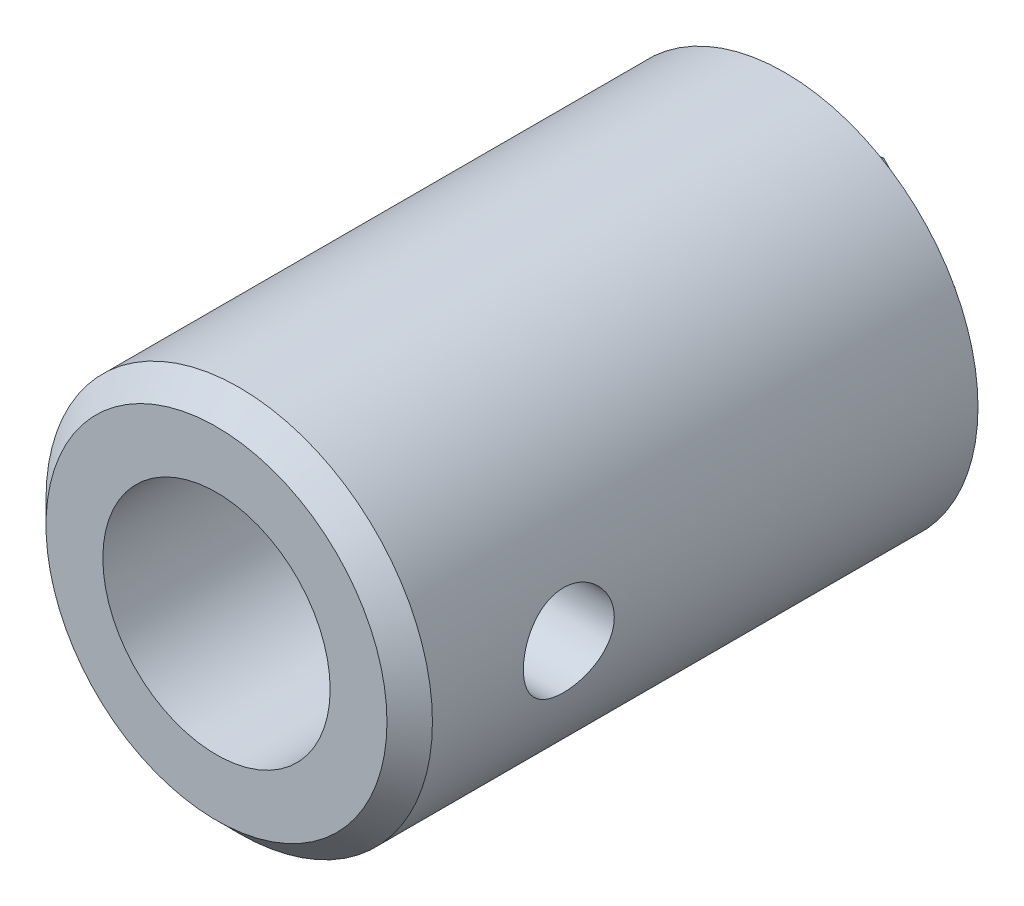
ISO-10303-21;
HEADER;
FILE_DESCRIPTION(('STEP AP214'),'2;1');
FILE_NAME('part.step','',(''),(''),'','','');
FILE_SCHEMA(('AUTOMOTIVE_DESIGN { 1 0 10303 214 1 1 1 1 }'));
ENDSEC;
DATA;
#1=APPLICATION_CONTEXT('core data for automotive mechanical design processes');
#2=APPLICATION_PROTOCOL_DEFINITION('international standard','automotive_design',2000,#1);
#3=PRODUCT_CONTEXT('',#1,'mechanical');
#4=PRODUCT('Part','Part','',(#3));
#5=PRODUCT_RELATED_PRODUCT_CATEGORY('part','',(#4));
#6=PRODUCT_DEFINITION_FORMATION('','',#4);
#7=PRODUCT_DEFINITION_CONTEXT('part definition',#1,'design');
#8=PRODUCT_DEFINITION('design','',#6,#7);
#9=PRODUCT_DEFINITION_SHAPE('','',#8);
#10=(LENGTH_UNIT() NAMED_UNIT(*) SI_UNIT(.MILLI.,.METRE.));
#11=(NAMED_UNIT(*) PLANE_ANGLE_UNIT() SI_UNIT($,.RADIAN.));
#12=(NAMED_UNIT(*) SI_UNIT($,.STERADIAN.) SOLID_ANGLE_UNIT());
#13=UNCERTAINTY_MEASURE_WITH_UNIT(LENGTH_MEASURE(1.E-05),#10,'distance_accuracy_value','');
#14=(GEOMETRIC_REPRESENTATION_CONTEXT(3) GLOBAL_UNCERTAINTY_ASSIGNED_CONTEXT((#13)) GLOBAL_UNIT_ASSIGNED_CONTEXT((#10,
#11,#12)) REPRESENTATION_CONTEXT('',''));
#15=CARTESIAN_POINT('',(0.,0.,0.));
#16=DIRECTION('',(0.,0.,1.));
#17=DIRECTION('',(1.,0.,0.));
#18=AXIS2_PLACEMENT_3D('',#15,#16,#17);
#19=CARTESIAN_POINT('',(0.,0.,0.));
#20=DIRECTION('',(0.,0.,1.));
#21=DIRECTION('',(1.,0.,0.));
#22=AXIS2_PLACEMENT_3D('',#19,#20,#21);
#23=PLANE('',#22);
#24=CARTESIAN_POINT('',(0.,0.,0.));
#25=DIRECTION('',(0.,0.,1.));
#26=DIRECTION('',(1.,0.,0.));
#27=AXIS2_PLACEMENT_3D('',#24,#25,#26);
#28=CIRCLE('',#27,8.5);
#29=CARTESIAN_POINT('',(8.5,0.,0.));
#30=VERTEX_POINT('',#29);
#31=EDGE_CURVE('E126',#30,#30,#28,.T.);
#32=ORIENTED_EDGE('',*,*,#31,.F.);
#33=EDGE_LOOP('',(#32));
#34=FACE_BOUND('',#33,.T.);
#35=DIRECTION('',(0.681876905278028,-0.731466941186312,0.));
#36=VECTOR('',#35,1.);
#37=CARTESIAN_POINT('',(1.35114050547941,4.41675816270103,0.));
#38=LINE('',#37,#36);
#39=CARTESIAN_POINT('',(1.35114050547941,4.41675816270103,0.));
#40=VERTEX_POINT('',#39);
#41=CARTESIAN_POINT('',(4.50059502401108,1.0382570795232,0.));
#42=VERTEX_POINT('',#41);
#43=EDGE_CURVE('E114',#40,#42,#38,.T.);
#44=ORIENTED_EDGE('',*,*,#43,.F.);
#45=DIRECTION('',(0.974407405734858,0.224789251631532,0.));
#46=VECTOR('',#45,1.);
#47=CARTESIAN_POINT('',(-3.14945451853167,3.37850108317783,0.));
#48=LINE('',#47,#46);
#49=CARTESIAN_POINT('',(-3.14945451853167,3.37850108317784,0.));
#50=VERTEX_POINT('',#49);
#51=EDGE_CURVE('E111',#50,#40,#48,.T.);
#52=ORIENTED_EDGE('',*,*,#51,.F.);
#53=DIRECTION('',(0.29253050045683,0.956256192817844,0.));
#54=VECTOR('',#53,1.);
#55=CARTESIAN_POINT('',(-4.50059502401108,-1.0382570795232,0.));
#56=LINE('',#55,#54);
#57=CARTESIAN_POINT('',(-4.50059502401108,-1.0382570795232,0.));
#58=VERTEX_POINT('',#57);
#59=EDGE_CURVE('E241',#58,#50,#56,.T.);
#60=ORIENTED_EDGE('',*,*,#59,.F.);
#61=DIRECTION('',(-0.681876905278028,0.731466941186312,0.));
#62=VECTOR('',#61,1.);
#63=CARTESIAN_POINT('',(-1.35114050547941,-4.41675816270103,0.));
#64=LINE('',#63,#62);
#65=CARTESIAN_POINT('',(-1.35114050547941,-4.41675816270103,0.));
#66=VERTEX_POINT('',#65);
#67=EDGE_CURVE('E238',#66,#58,#64,.T.);
#68=ORIENTED_EDGE('',*,*,#67,.F.);
#69=DIRECTION('',(-0.974407405734858,-0.224789251631532,0.));
#70=VECTOR('',#69,1.);
#71=CARTESIAN_POINT('',(3.14945451853167,-3.37850108317783,0.));
#72=LINE('',#71,#70);
#73=CARTESIAN_POINT('',(3.14945451853167,-3.37850108317783,0.));
#74=VERTEX_POINT('',#73);
#75=EDGE_CURVE('E60',#74,#66,#72,.T.);
#76=ORIENTED_EDGE('',*,*,#75,.F.);
#77=DIRECTION('',(-0.292530500456829,-0.956256192817844,0.));
#78=VECTOR('',#77,1.);
#79=CARTESIAN_POINT('',(4.50059502401108,1.0382570795232,0.));
#80=LINE('',#79,#78);
#81=EDGE_CURVE('E55',#42,#74,#80,.T.);
#82=ORIENTED_EDGE('',*,*,#81,.F.);
#83=EDGE_LOOP('',(#44,#52,#60,#68,#76,#82));
#84=FACE_BOUND('',#83,.T.);
#85=ADVANCED_FACE('F40',(#34,#84),#23,.F.);
#86=CARTESIAN_POINT('',(0.,0.,5.));
#87=DIRECTION('',(0.,0.,1.));
#88=DIRECTION('',(1.,0.,0.));
#89=AXIS2_PLACEMENT_3D('',#86,#87,#88);
#90=PLANE('',#89);
#91=CARTESIAN_POINT('',(0.,0.,5.));
#92=DIRECTION('',(0.,0.,1.));
#93=DIRECTION('',(1.,0.,0.));
#94=AXIS2_PLACEMENT_3D('',#91,#92,#93);
#95=CIRCLE('',#94,5.);
#96=CARTESIAN_POINT('',(5.,0.,5.));
#97=VERTEX_POINT('',#96);
#98=EDGE_CURVE('E129',#97,#97,#95,.F.);
#99=ORIENTED_EDGE('',*,*,#98,.F.);
#100=EDGE_LOOP('',(#99));
#101=FACE_BOUND('',#100,.T.);
#102=CARTESIAN_POINT('',(0.,0.,5.));
#103=DIRECTION('',(0.,0.,1.));
#104=DIRECTION('',(1.,0.,0.));
#105=AXIS2_PLACEMENT_3D('',#102,#103,#104);
#106=CIRCLE('',#105,2.);
#107=CARTESIAN_POINT('',(2.,0.,5.));
#108=VERTEX_POINT('',#107);
#109=EDGE_CURVE('E118',#108,#108,#106,.T.);
#110=ORIENTED_EDGE('',*,*,#109,.F.);
#111=EDGE_LOOP('',(#110));
#112=FACE_BOUND('',#111,.T.);
#113=ADVANCED_FACE('F152',(#101,#112),#90,.T.);
#114=CARTESIAN_POINT('',(0.,0.,5.));
#115=DIRECTION('',(0.,0.,-1.));
#116=DIRECTION('',(-1.,0.,0.));
#117=AXIS2_PLACEMENT_3D('',#114,#115,#116);
#118=CYLINDRICAL_SURFACE('',#117,8.5);
#119=CARTESIAN_POINT('',(8.5,0.,16.));
#120=CARTESIAN_POINT('',(8.49999801750481,0.110707222526124,16.0000034564406));
#121=CARTESIAN_POINT('',(8.49781540060716,0.221454521072923,16.0092230526165));
#122=CARTESIAN_POINT('',(8.48931965269305,0.439788787350876,16.04581087604));
#123=CARTESIAN_POINT('',(8.48300388462288,0.547373691572941,16.0731906901113));
#124=CARTESIAN_POINT('',(8.4669430800191,0.756197517316249,16.1451823953729));
#125=CARTESIAN_POINT('',(8.45720190485864,0.857443433845184,16.1897748886609));
#126=CARTESIAN_POINT('',(8.43533444577621,1.0510155369327,16.29486106804));
#127=CARTESIAN_POINT('',(8.42320814931182,1.14334167658186,16.3553548377503));
#128=CARTESIAN_POINT('',(8.39764327718341,1.31815374652725,16.4917031152311));
#129=CARTESIAN_POINT('',(8.38418634599685,1.40045211681902,16.5677946687571));
#130=CARTESIAN_POINT('',(8.3576023587247,1.55124417062838,16.7326703662886));
#131=CARTESIAN_POINT('',(8.34447533602387,1.61973646193728,16.8214557888058));
#132=CARTESIAN_POINT('',(8.31985447393301,1.74182760532487,17.0106214613995));
#133=CARTESIAN_POINT('',(8.30838404762359,1.79522157802198,17.1111372665124));
#134=CARTESIAN_POINT('',(8.28864082978449,1.88428453492285,17.3200304396746));
#135=CARTESIAN_POINT('',(8.28036759056153,1.91995600096022,17.4284067045193));
#136=CARTESIAN_POINT('',(8.2681433438507,1.97193118009561,17.6478951195353));
#137=CARTESIAN_POINT('',(8.26411772364193,1.98856967737172,17.7589237439898));
#138=CARTESIAN_POINT('',(8.26062082026474,2.00304855484246,17.9822637963029));
#139=CARTESIAN_POINT('',(8.26114888525169,2.00089162553843,18.0945750382607));
#140=CARTESIAN_POINT('',(8.26663238190337,1.97810910167244,18.3147643318213));
#141=CARTESIAN_POINT('',(8.27149336028226,1.95787749619193,18.4226858628878));
#142=CARTESIAN_POINT('',(8.28494503088792,1.90014632726017,18.6335585112896));
#143=CARTESIAN_POINT('',(8.29353596158136,1.86264565973852,18.736509310364));
#144=CARTESIAN_POINT('',(8.31356933146056,1.77109260203966,18.9355993150008));
#145=CARTESIAN_POINT('',(8.32503693669168,1.71689311623115,19.0316682392775));
#146=CARTESIAN_POINT('',(8.34951675356641,1.59358407474821,19.2134911691473));
#147=CARTESIAN_POINT('',(8.36252920661224,1.52447218743741,19.2992435584236));
#148=CARTESIAN_POINT('',(8.38903394638453,1.37123756634556,19.4602622907461));
#149=CARTESIAN_POINT('',(8.40253007115743,1.28678108396336,19.5352107455763));
#150=CARTESIAN_POINT('',(8.42818503228671,1.10634012247957,19.6699368159688));
#151=CARTESIAN_POINT('',(8.4403438364415,1.01035536590296,19.7297140662663));
#152=CARTESIAN_POINT('',(8.46200394642273,0.809160897355915,19.8324988202337));
#153=CARTESIAN_POINT('',(8.47149782003105,0.703926440039183,19.8754595532797));
#154=CARTESIAN_POINT('',(8.48670384958574,0.487457687798598,19.942996137397));
#155=CARTESIAN_POINT('',(8.49241664415731,0.376224409511196,19.9675750932463));
#156=CARTESIAN_POINT('',(8.49932407764157,0.153637663571891,19.9971762025668));
#157=CARTESIAN_POINT('',(8.50061885597204,0.0423448759149325,20.0026318862663));
#158=CARTESIAN_POINT('',(8.49882735084224,-0.179562447634433,19.9950138381952));
#159=CARTESIAN_POINT('',(8.49574141406895,-0.290177036503304,19.9819415727148));
#160=CARTESIAN_POINT('',(8.4855989282765,-0.506115547274072,19.9379972132707));
#161=CARTESIAN_POINT('',(8.47859417913237,-0.611489350752371,19.9073572055214));
#162=CARTESIAN_POINT('',(8.46140046160523,-0.815599145285605,19.8294085651773));
#163=CARTESIAN_POINT('',(8.45121119444604,-0.914334512456049,19.7820983685079));
#164=CARTESIAN_POINT('',(8.42853504656538,-1.10412269234789,19.6712816590721));
#165=CARTESIAN_POINT('',(8.41601380204274,-1.19502614893552,19.6075265491899));
#166=CARTESIAN_POINT('',(8.39012409804059,-1.36499902472579,19.4659521169624));
#167=CARTESIAN_POINT('',(8.37675551017066,-1.44406664441852,19.3881306599449));
#168=CARTESIAN_POINT('',(8.35032432460353,-1.58987521562228,19.2186302340775));
#169=CARTESIAN_POINT('',(8.337274528673,-1.65631382120375,19.1266887849848));
#170=CARTESIAN_POINT('',(8.31328366919846,-1.77281313863698,18.9327014872794));
#171=CARTESIAN_POINT('',(8.30234251141978,-1.82287458245114,18.8306560905191));
#172=CARTESIAN_POINT('',(8.28392155078471,-1.90483844015696,18.6199148677443));
#173=CARTESIAN_POINT('',(8.27642150929975,-1.936847290954,18.5112622974374));
#174=CARTESIAN_POINT('',(8.26570319885666,-1.98209519216249,18.2899179669515));
#175=CARTESIAN_POINT('',(8.26248411864936,-1.99533779883918,18.1772269762176));
#176=CARTESIAN_POINT('',(8.26074892411982,-2.00250786658812,17.9540670323244));
#177=CARTESIAN_POINT('',(8.26211563101112,-1.99691656853304,17.8436141892436));
#178=CARTESIAN_POINT('',(8.26912996315445,-1.96766652984528,17.6252729639171));
#179=CARTESIAN_POINT('',(8.27477752057995,-1.94400807547166,17.5173845410683));
#180=CARTESIAN_POINT('',(8.28965579164934,-1.87954382970523,17.3076894774335));
#181=CARTESIAN_POINT('',(8.29886967522321,-1.83881850605662,17.205856824553));
#182=CARTESIAN_POINT('',(8.31984668167287,-1.74144219098133,17.0104017866367));
#183=CARTESIAN_POINT('',(8.33161011669299,-1.68478924926668,16.9167804088893));
#184=CARTESIAN_POINT('',(8.35670265527952,-1.55561482360098,16.7380569414012));
#185=CARTESIAN_POINT('',(8.37006180674132,-1.4827549558821,16.6532035961677));
#186=CARTESIAN_POINT('',(8.3966506561662,-1.32390732881552,16.4967706459752));
#187=CARTESIAN_POINT('',(8.40988032313166,-1.23791650403864,16.4251941491676));
#188=CARTESIAN_POINT('',(8.43496426083158,-1.05363595816287,16.2962710677008));
#189=CARTESIAN_POINT('',(8.44679396805159,-0.955175905199521,16.2391628549814));
#190=CARTESIAN_POINT('',(8.4674927014593,-0.749789351513639,16.1423991533379));
#191=CARTESIAN_POINT('',(8.47636402617268,-0.642869503952003,16.1027301073287));
#192=CARTESIAN_POINT('',(8.48870155772743,-0.446656582230613,16.0484396269269));
#193=CARTESIAN_POINT('',(8.49291078599891,-0.358363661577137,16.0303117328842));
#194=CARTESIAN_POINT('',(8.49856073191377,-0.180055929660539,16.0060908677956));
#195=CARTESIAN_POINT('',(8.5000016124177,-0.0900412200041043,15.9999971887821));
#196=CARTESIAN_POINT('',(8.5,0.,16.));
#197=B_SPLINE_CURVE_WITH_KNOTS('',3,(#119,#120,#121,#122,#123,#124,#125,#126,#127,#128,#129,
#130,#131,#132,#133,#134,#135,#136,#137,#138,#139,#140,#141,#142,#143,#144,#145,#146,#147,#148,
#149,#150,#151,#152,#153,#154,#155,#156,#157,#158,#159,#160,#161,#162,#163,#164,#165,#166,#167,
#168,#169,#170,#171,#172,#173,#174,#175,#176,#177,#178,#179,#180,#181,#182,#183,#184,#185,#186,
#187,#188,#189,#190,#191,#192,#193,#194,#195,#196),.UNSPECIFIED.,.T.,.F.,(4,2,2,2,2,2,2,2,2,2,2,
2,2,2,2,2,2,2,2,2,2,2,2,2,2,2,2,2,2,2,2,2,2,2,2,2,2,2,4),(0.,0.33179188856896,0.663795675313147,
0.995426396224179,1.32705886109823,1.66416482514813,2.00130476606585,2.34282124715151,
2.68428988928473,3.01965509679603,3.35497229870821,3.68315396602227,4.0113566180301,
4.34253723635987,4.67376967418079,5.0133309031367,5.3529003066598,5.69340753264886,
6.03385723219516,6.36653706536538,6.69919057193507,7.02754747309658,7.35593519043891,
7.68961218148234,8.02333985305756,8.3642590808605,8.70516306950514,9.04403551593491,
9.3828437363253,9.7130611342689,10.0432733003012,10.3719457765065,10.7006585151894,
11.0370154300388,11.3734509879818,11.7151138135869,12.0565105612022,12.3263818797879,
12.5962373214883),.UNSPECIFIED.);
#198=CARTESIAN_POINT('',(8.5,0.,16.));
#199=VERTEX_POINT('',#198);
#200=EDGE_CURVE('E174',#199,#199,#197,.T.);
#201=ORIENTED_EDGE('',*,*,#200,.F.);
#202=EDGE_LOOP('',(#201));
#203=FACE_BOUND('',#202,.T.);
#204=CARTESIAN_POINT('',(0.,0.,24.));
#205=DIRECTION('',(0.,0.,1.));
#206=DIRECTION('',(1.,0.,0.));
#207=AXIS2_PLACEMENT_3D('',#204,#205,#206);
#208=CIRCLE('',#207,8.5);
#209=CARTESIAN_POINT('',(8.5,0.,24.));
#210=VERTEX_POINT('',#209);
#211=EDGE_CURVE('E12',#210,#210,#208,.F.);
#212=ORIENTED_EDGE('',*,*,#211,.T.);
#213=EDGE_LOOP('',(#212));
#214=FACE_BOUND('',#213,.T.);
#215=ORIENTED_EDGE('',*,*,#31,.T.);
#216=EDGE_LOOP('',(#215));
#217=FACE_BOUND('',#216,.T.);
#218=ADVANCED_FACE('F158',(#203,#214,#217),#118,.T.);
#219=CARTESIAN_POINT('',(0.,0.,5.));
#220=DIRECTION('',(0.,0.,-1.));
#221=DIRECTION('',(-1.,0.,0.));
#222=AXIS2_PLACEMENT_3D('',#219,#220,#221);
#223=CYLINDRICAL_SURFACE('',#222,2.);
#224=ORIENTED_EDGE('',*,*,#109,.T.);
#225=EDGE_LOOP('',(#224));
#226=FACE_BOUND('',#225,.T.);
#227=CARTESIAN_POINT('',(0.,0.,-3.));
#228=DIRECTION('',(0.,0.,-1.));
#229=DIRECTION('',(-1.,0.,0.));
#230=AXIS2_PLACEMENT_3D('',#227,#228,#229);
#231=CIRCLE('',#230,2.);
#232=CARTESIAN_POINT('',(-2.,0.,-3.));
#233=VERTEX_POINT('',#232);
#234=EDGE_CURVE('E180',#233,#233,#231,.T.);
#235=ORIENTED_EDGE('',*,*,#234,.T.);
#236=EDGE_LOOP('',(#235));
#237=FACE_BOUND('',#236,.T.);
#238=ADVANCED_FACE('F164',(#226,#237),#223,.F.);
#239=CARTESIAN_POINT('',(0.,0.,25.));
#240=DIRECTION('',(0.,0.,-1.));
#241=DIRECTION('',(-1.,0.,0.));
#242=AXIS2_PLACEMENT_3D('',#239,#240,#241);
#243=CYLINDRICAL_SURFACE('',#242,5.);
#244=CARTESIAN_POINT('',(5.,0.,16.));
#245=CARTESIAN_POINT('',(4.99999271227085,0.107493005442891,16.0000098518237));
#246=CARTESIAN_POINT('',(4.99649294306932,0.215172564090674,16.0087177520884));
#247=CARTESIAN_POINT('',(4.98283453100641,0.427496480417896,16.0432477035212));
#248=CARTESIAN_POINT('',(4.97265778698877,0.532131777561249,16.0691162790861));
#249=CARTESIAN_POINT('',(4.94674209213118,0.734953922727404,16.1368760780588));
#250=CARTESIAN_POINT('',(4.93102136364072,0.83316066161696,16.1787148462167));
#251=CARTESIAN_POINT('',(4.89556610796078,1.02107197032837,16.2770191733265));
#252=CARTESIAN_POINT('',(4.87583297458057,1.11077947675099,16.3334796549189));
#253=CARTESIAN_POINT('',(4.83330886170419,1.2835010075704,16.4622354985609));
#254=CARTESIAN_POINT('',(4.8104229692919,1.36606227255022,16.5351066562403));
#255=CARTESIAN_POINT('',(4.76460576906194,1.51817500478473,16.6934000034768));
#256=CARTESIAN_POINT('',(4.74167444453792,1.58772010713354,16.7788282972117));
#257=CARTESIAN_POINT('',(4.69722791797136,1.71487456729288,16.9644280702423));
#258=CARTESIAN_POINT('',(4.67582115964951,1.77181498119548,17.0650864860232));
#259=CARTESIAN_POINT('',(4.63833647186792,1.86775471903715,17.27553639842));
#260=CARTESIAN_POINT('',(4.62225601244176,1.90676256428584,17.3853235278484));
#261=CARTESIAN_POINT('',(4.59826357660818,1.96389882339587,17.6057123335921));
#262=CARTESIAN_POINT('',(4.59001420355605,1.98289396580565,17.7160512355762));
#263=CARTESIAN_POINT('',(4.58164004049144,2.00217296164003,17.9386349983073));
#264=CARTESIAN_POINT('',(4.58151125522768,2.00246601631323,18.050878894625));
#265=CARTESIAN_POINT('',(4.58910500279994,1.98498936750455,18.265756671458));
#266=CARTESIAN_POINT('',(4.5962817503845,1.96847531430514,18.368515714409));
#267=CARTESIAN_POINT('',(4.61676187607836,1.91994688029782,18.5696595560067));
#268=CARTESIAN_POINT('',(4.63006632321673,1.88792979480463,18.6680435881103));
#269=CARTESIAN_POINT('',(4.6615948508853,1.80869473255108,18.860017836196));
#270=CARTESIAN_POINT('',(4.67991379280788,1.76117986231532,18.9534692390547));
#271=CARTESIAN_POINT('',(4.7193811638989,1.65250646073222,19.1314158163616));
#272=CARTESIAN_POINT('',(4.74053065456848,1.59134280510085,19.2159076094028));
#273=CARTESIAN_POINT('',(4.78526736742271,1.45155059945444,19.380409728802));
#274=CARTESIAN_POINT('',(4.80891664976152,1.37193746297064,19.459568729446));
#275=CARTESIAN_POINT('',(4.85459824958282,1.20031442743019,19.603684478002));
#276=CARTESIAN_POINT('',(4.87663024445325,1.10830206533443,19.6686383974103));
#277=CARTESIAN_POINT('',(4.91714681264548,0.912077652605843,19.7836174474158));
#278=CARTESIAN_POINT('',(4.93555270095415,0.807660491346477,19.8333222811971));
#279=CARTESIAN_POINT('',(4.96614828328759,0.591023765482881,19.9141678610781));
#280=CARTESIAN_POINT('',(4.97834113462382,0.478808196849674,19.9453180375574));
#281=CARTESIAN_POINT('',(4.99456139506911,0.25689588760782,19.9864482954197));
#282=CARTESIAN_POINT('',(4.99902945833514,0.147443293985535,19.9975724542536));
#283=CARTESIAN_POINT('',(5.00068478510631,-0.0718453098078173,20.0017131005286));
#284=CARTESIAN_POINT('',(4.99787393582291,-0.181681213223923,19.9947342815475));
#285=CARTESIAN_POINT('',(4.98557567063753,-0.393432739121987,19.963708247448));
#286=CARTESIAN_POINT('',(4.97639391345523,-0.495482491775474,19.940442019649));
#287=CARTESIAN_POINT('',(4.952594414055,-0.69413542806078,19.8785642916902));
#288=CARTESIAN_POINT('',(4.9379759735653,-0.790737910224845,19.8399508203313));
#289=CARTESIAN_POINT('',(4.90416594770812,-0.979078785816702,19.7472150603201));
#290=CARTESIAN_POINT('',(4.88484815979803,-1.07057802275541,19.6926545279569));
#291=CARTESIAN_POINT('',(4.84373364745525,-1.24344359124656,19.5700596760944));
#292=CARTESIAN_POINT('',(4.8219359311027,-1.32480584076113,19.5020199570774));
#293=CARTESIAN_POINT('',(4.77645117638112,-1.48072304302882,19.3491299870504));
#294=CARTESIAN_POINT('',(4.75273441425052,-1.55447393380607,19.2634664584938));
#295=CARTESIAN_POINT('',(4.70741672917132,-1.68675119741371,19.0805599169906));
#296=CARTESIAN_POINT('',(4.68581615526511,-1.74527506133751,18.9833149996601));
#297=CARTESIAN_POINT('',(4.64714299907708,-1.84580750193163,18.7785383054059));
#298=CARTESIAN_POINT('',(4.63011630884788,-1.88765059453446,18.6709160007877));
#299=CARTESIAN_POINT('',(4.60323673477931,-1.95229621970531,18.4492663482848));
#300=CARTESIAN_POINT('',(4.59337855695998,-1.97511280526932,18.3352437941876));
#301=CARTESIAN_POINT('',(4.58271759299926,-1.9997156172784,18.1128720982255));
#302=CARTESIAN_POINT('',(4.58131421008171,-2.00289708230287,18.0047051604066));
#303=CARTESIAN_POINT('',(4.58614836033098,-1.99180315927753,17.7894551422867));
#304=CARTESIAN_POINT('',(4.59238492324793,-1.97752998791379,17.6823719260974));
#305=CARTESIAN_POINT('',(4.6112664907902,-1.93307136615365,17.476667810145));
#306=CARTESIAN_POINT('',(4.62364831827449,-1.90353749357098,17.377879725567));
#307=CARTESIAN_POINT('',(4.65324001232696,-1.83000544849101,17.1866213703865));
#308=CARTESIAN_POINT('',(4.67045121206007,-1.78600328139382,17.0941528531002));
#309=CARTESIAN_POINT('',(4.70898609604491,-1.68187276275973,16.9123903807292));
#310=CARTESIAN_POINT('',(4.73048882313242,-1.62096533515949,16.8235813298695));
#311=CARTESIAN_POINT('',(4.77463804372237,-1.4858921192715,16.6570066827962));
#312=CARTESIAN_POINT('',(4.79728488048406,-1.41172233481812,16.5792444278717));
#313=CARTESIAN_POINT('',(4.84293567087394,-1.24650550627247,16.4317971467364));
#314=CARTESIAN_POINT('',(4.86586757962185,-1.15467600114614,16.3629626931019));
#315=CARTESIAN_POINT('',(4.90800406713717,-0.959900320285781,16.2416629573784));
#316=CARTESIAN_POINT('',(4.92720691092906,-0.856949004547239,16.1892052878475));
#317=CARTESIAN_POINT('',(4.95939714815861,-0.644738062495204,16.1033777848097));
#318=CARTESIAN_POINT('',(4.97249363055028,-0.535631618219697,16.0696706764397));
#319=CARTESIAN_POINT('',(4.99144306209366,-0.312876546281222,16.0213608790457));
#320=CARTESIAN_POINT('',(4.99731899495638,-0.199243525858914,16.0066975632561));
#321=CARTESIAN_POINT('',(4.99975899504136,-0.0569122978909305,16.0006046190217));
#322=CARTESIAN_POINT('',(5.00000192969176,-0.0284626887407588,15.9999973913708));
#323=CARTESIAN_POINT('',(5.,0.,16.));
#324=B_SPLINE_CURVE_WITH_KNOTS('',3,(#244,#245,#246,#247,#248,#249,#250,#251,#252,#253,#254,
#255,#256,#257,#258,#259,#260,#261,#262,#263,#264,#265,#266,#267,#268,#269,#270,#271,#272,#273,
#274,#275,#276,#277,#278,#279,#280,#281,#282,#283,#284,#285,#286,#287,#288,#289,#290,#291,#292,
#293,#294,#295,#296,#297,#298,#299,#300,#301,#302,#303,#304,#305,#306,#307,#308,#309,#310,#311,
#312,#313,#314,#315,#316,#317,#318,#319,#320,#321,#322,#323),.UNSPECIFIED.,.T.,.F.,(4,2,2,2,2,2,
2,2,2,2,2,2,2,2,2,2,2,2,2,2,2,2,2,2,2,2,2,2,2,2,2,2,2,2,2,2,2,2,2,4),(0.,0.322402987893071,
0.645683636007935,0.967911457471582,1.29002753567984,1.62597381700398,1.96208394934412,
2.31315258819217,2.66405423118268,2.99904105308829,3.33386306340488,3.64538328401373,
3.95695787256048,4.27489126298816,4.59294421938184,4.93558349186558,5.27829092839734,
5.62776913162807,5.97706956113791,6.30569184528008,6.63422893570083,6.94800455564366,
7.26182048993797,7.58523513398264,7.9087795949897,8.25368474624415,8.59864669043749,
8.94695045140829,9.29499672645935,9.61799673392749,9.94095572563047,10.2511431854877,
10.5614163580516,10.8894546805669,11.2175920134839,11.5670042353384,11.9165786364053,
12.2596430101332,12.6016125240434,12.686980458968),.UNSPECIFIED.);
#325=CARTESIAN_POINT('',(5.,0.,16.));
#326=VERTEX_POINT('',#325);
#327=EDGE_CURVE('E177',#326,#326,#324,.T.);
#328=ORIENTED_EDGE('',*,*,#327,.T.);
#329=EDGE_LOOP('',(#328));
#330=FACE_BOUND('',#329,.T.);
#331=CARTESIAN_POINT('',(0.,0.,25.));
#332=DIRECTION('',(0.,0.,1.));
#333=DIRECTION('',(1.,0.,0.));
#334=AXIS2_PLACEMENT_3D('',#331,#332,#333);
#335=CIRCLE('',#334,5.);
#336=CARTESIAN_POINT('',(5.,0.,25.));
#337=VERTEX_POINT('',#336);
#338=EDGE_CURVE('E115',#337,#337,#335,.T.);
#339=ORIENTED_EDGE('',*,*,#338,.T.);
#340=EDGE_LOOP('',(#339));
#341=FACE_BOUND('',#340,.T.);
#342=ORIENTED_EDGE('',*,*,#98,.T.);
#343=EDGE_LOOP('',(#342));
#344=FACE_BOUND('',#343,.T.);
#345=ADVANCED_FACE('F169',(#330,#341,#344),#243,.F.);
#346=CARTESIAN_POINT('',(0.,0.,25.));
#347=DIRECTION('',(0.,0.,1.));
#348=DIRECTION('',(1.,0.,0.));
#349=AXIS2_PLACEMENT_3D('',#346,#347,#348);
#350=PLANE('',#349);
#351=CARTESIAN_POINT('',(0.,0.,25.));
#352=DIRECTION('',(0.,0.,1.));
#353=DIRECTION('',(1.,0.,0.));
#354=AXIS2_PLACEMENT_3D('',#351,#352,#353);
#355=CIRCLE('',#354,7.5);
#356=CARTESIAN_POINT('',(7.5,0.,25.));
#357=VERTEX_POINT('',#356);
#358=EDGE_CURVE('E48',#357,#357,#355,.T.);
#359=ORIENTED_EDGE('',*,*,#358,.T.);
#360=EDGE_LOOP('',(#359));
#361=FACE_BOUND('',#360,.T.);
#362=ORIENTED_EDGE('',*,*,#338,.F.);
#363=EDGE_LOOP('',(#362));
#364=FACE_BOUND('',#363,.T.);
#365=ADVANCED_FACE('F134',(#361,#364),#350,.T.);
#366=CARTESIAN_POINT('',(0.,0.,-3.));
#367=DIRECTION('',(0.,0.,-1.));
#368=DIRECTION('',(-1.,0.,0.));
#369=AXIS2_PLACEMENT_3D('',#366,#367,#368);
#370=PLANE('',#369);
#371=DIRECTION('',(0.681876905278028,-0.731466941186312,0.));
#372=VECTOR('',#371,1.);
#373=CARTESIAN_POINT('',(1.35114050547941,4.41675816270103,-3.));
#374=LINE('',#373,#372);
#375=CARTESIAN_POINT('',(1.35114050547941,4.41675816270103,-3.));
#376=VERTEX_POINT('',#375);
#377=CARTESIAN_POINT('',(4.50059502401108,1.0382570795232,-3.));
#378=VERTEX_POINT('',#377);
#379=EDGE_CURVE('E101',#376,#378,#374,.T.);
#380=ORIENTED_EDGE('',*,*,#379,.T.);
#381=DIRECTION('',(-0.292530500456829,-0.956256192817844,0.));
#382=VECTOR('',#381,1.);
#383=CARTESIAN_POINT('',(4.50059502401108,1.0382570795232,-3.));
#384=LINE('',#383,#382);
#385=CARTESIAN_POINT('',(3.14945451853167,-3.37850108317783,-3.));
#386=VERTEX_POINT('',#385);
#387=EDGE_CURVE('E90',#378,#386,#384,.T.);
#388=ORIENTED_EDGE('',*,*,#387,.T.);
#389=DIRECTION('',(-0.974407405734858,-0.224789251631532,0.));
#390=VECTOR('',#389,1.);
#391=CARTESIAN_POINT('',(3.14945451853167,-3.37850108317783,-3.));
#392=LINE('',#391,#390);
#393=CARTESIAN_POINT('',(-1.35114050547941,-4.41675816270103,-3.));
#394=VERTEX_POINT('',#393);
#395=EDGE_CURVE('E100',#386,#394,#392,.T.);
#396=ORIENTED_EDGE('',*,*,#395,.T.);
#397=DIRECTION('',(-0.681876905278028,0.731466941186312,0.));
#398=VECTOR('',#397,1.);
#399=CARTESIAN_POINT('',(-1.35114050547941,-4.41675816270103,-3.));
#400=LINE('',#399,#398);
#401=CARTESIAN_POINT('',(-4.50059502401108,-1.0382570795232,-3.));
#402=VERTEX_POINT('',#401);
#403=EDGE_CURVE('E230',#394,#402,#400,.T.);
#404=ORIENTED_EDGE('',*,*,#403,.T.);
#405=DIRECTION('',(0.29253050045683,0.956256192817844,0.));
#406=VECTOR('',#405,1.);
#407=CARTESIAN_POINT('',(-4.50059502401108,-1.0382570795232,-3.));
#408=LINE('',#407,#406);
#409=CARTESIAN_POINT('',(-3.14945451853167,3.37850108317783,-3.));
#410=VERTEX_POINT('',#409);
#411=EDGE_CURVE('E232',#402,#410,#408,.T.);
#412=ORIENTED_EDGE('',*,*,#411,.T.);
#413=DIRECTION('',(0.974407405734858,0.224789251631532,0.));
#414=VECTOR('',#413,1.);
#415=CARTESIAN_POINT('',(-3.14945451853167,3.37850108317783,-3.));
#416=LINE('',#415,#414);
#417=EDGE_CURVE('E107',#410,#376,#416,.T.);
#418=ORIENTED_EDGE('',*,*,#417,.T.);
#419=EDGE_LOOP('',(#380,#388,#396,#404,#412,#418));
#420=FACE_BOUND('',#419,.T.);
#421=ORIENTED_EDGE('',*,*,#234,.F.);
#422=EDGE_LOOP('',(#421));
#423=FACE_BOUND('',#422,.T.);
#424=ADVANCED_FACE('F104',(#420,#423),#370,.T.);
#425=CARTESIAN_POINT('',(1.35114050547941,4.41675816270103,-3.));
#426=DIRECTION('',(-0.731466941186312,-0.681876905278028,0.));
#427=DIRECTION('',(0.681876905278028,-0.731466941186312,0.));
#428=AXIS2_PLACEMENT_3D('',#425,#426,#427);
#429=PLANE('',#428);
#430=ORIENTED_EDGE('',*,*,#43,.T.);
#431=DIRECTION('',(0.,0.,1.));
#432=VECTOR('',#431,1.);
#433=CARTESIAN_POINT('',(4.50059502401108,1.0382570795232,-3.));
#434=LINE('',#433,#432);
#435=EDGE_CURVE('E94',#378,#42,#434,.T.);
#436=ORIENTED_EDGE('',*,*,#435,.F.);
#437=ORIENTED_EDGE('',*,*,#379,.F.);
#438=DIRECTION('',(0.,0.,1.));
#439=VECTOR('',#438,1.);
#440=CARTESIAN_POINT('',(1.35114050547941,4.41675816270103,-3.));
#441=LINE('',#440,#439);
#442=EDGE_CURVE('E234',#376,#40,#441,.T.);
#443=ORIENTED_EDGE('',*,*,#442,.T.);
#444=EDGE_LOOP('',(#430,#436,#437,#443));
#445=FACE_BOUND('',#444,.T.);
#446=ADVANCED_FACE('F113',(#445),#429,.F.);
#447=CARTESIAN_POINT('',(4.50059502401108,1.0382570795232,-3.));
#448=DIRECTION('',(-0.956256192817843,0.292530500456829,0.));
#449=DIRECTION('',(-0.292530500456829,-0.956256192817844,0.));
#450=AXIS2_PLACEMENT_3D('',#447,#448,#449);
#451=PLANE('',#450);
#452=ORIENTED_EDGE('',*,*,#81,.T.);
#453=DIRECTION('',(0.,0.,1.));
#454=VECTOR('',#453,1.);
#455=CARTESIAN_POINT('',(3.14945451853167,-3.37850108317783,-3.));
#456=LINE('',#455,#454);
#457=EDGE_CURVE('E97',#386,#74,#456,.T.);
#458=ORIENTED_EDGE('',*,*,#457,.F.);
#459=ORIENTED_EDGE('',*,*,#387,.F.);
#460=ORIENTED_EDGE('',*,*,#435,.T.);
#461=EDGE_LOOP('',(#452,#458,#459,#460));
#462=FACE_BOUND('',#461,.T.);
#463=ADVANCED_FACE('F92',(#462),#451,.F.);
#464=CARTESIAN_POINT('',(3.14945451853167,-3.37850108317783,-3.));
#465=DIRECTION('',(-0.224789251631532,0.974407405734858,0.));
#466=DIRECTION('',(-0.974407405734858,-0.224789251631532,0.));
#467=AXIS2_PLACEMENT_3D('',#464,#465,#466);
#468=PLANE('',#467);
#469=ORIENTED_EDGE('',*,*,#75,.T.);
#470=DIRECTION('',(0.,0.,1.));
#471=VECTOR('',#470,1.);
#472=CARTESIAN_POINT('',(-1.35114050547941,-4.41675816270103,-3.));
#473=LINE('',#472,#471);
#474=EDGE_CURVE('E120',#394,#66,#473,.T.);
#475=ORIENTED_EDGE('',*,*,#474,.F.);
#476=ORIENTED_EDGE('',*,*,#395,.F.);
#477=ORIENTED_EDGE('',*,*,#457,.T.);
#478=EDGE_LOOP('',(#469,#475,#476,#477));
#479=FACE_BOUND('',#478,.T.);
#480=ADVANCED_FACE('F202',(#479),#468,.F.);
#481=CARTESIAN_POINT('',(-1.35114050547941,-4.41675816270103,-3.));
#482=DIRECTION('',(0.731466941186312,0.681876905278028,0.));
#483=DIRECTION('',(-0.681876905278028,0.731466941186312,0.));
#484=AXIS2_PLACEMENT_3D('',#481,#482,#483);
#485=PLANE('',#484);
#486=ORIENTED_EDGE('',*,*,#67,.T.);
#487=DIRECTION('',(0.,0.,1.));
#488=VECTOR('',#487,1.);
#489=CARTESIAN_POINT('',(-4.50059502401108,-1.0382570795232,-3.));
#490=LINE('',#489,#488);
#491=EDGE_CURVE('E250',#402,#58,#490,.T.);
#492=ORIENTED_EDGE('',*,*,#491,.F.);
#493=ORIENTED_EDGE('',*,*,#403,.F.);
#494=ORIENTED_EDGE('',*,*,#474,.T.);
#495=EDGE_LOOP('',(#486,#492,#493,#494));
#496=FACE_BOUND('',#495,.T.);
#497=ADVANCED_FACE('F198',(#496),#485,.F.);
#498=CARTESIAN_POINT('',(-4.50059502401108,-1.0382570795232,-3.));
#499=DIRECTION('',(0.956256192817844,-0.29253050045683,0.));
#500=DIRECTION('',(0.29253050045683,0.956256192817844,0.));
#501=AXIS2_PLACEMENT_3D('',#498,#499,#500);
#502=PLANE('',#501);
#503=ORIENTED_EDGE('',*,*,#59,.T.);
#504=DIRECTION('',(0.,0.,1.));
#505=VECTOR('',#504,1.);
#506=CARTESIAN_POINT('',(-3.14945451853167,3.37850108317783,-3.));
#507=LINE('',#506,#505);
#508=EDGE_CURVE('E247',#410,#50,#507,.T.);
#509=ORIENTED_EDGE('',*,*,#508,.F.);
#510=ORIENTED_EDGE('',*,*,#411,.F.);
#511=ORIENTED_EDGE('',*,*,#491,.T.);
#512=EDGE_LOOP('',(#503,#509,#510,#511));
#513=FACE_BOUND('',#512,.T.);
#514=ADVANCED_FACE('F147',(#513),#502,.F.);
#515=CARTESIAN_POINT('',(-3.14945451853167,3.37850108317783,-3.));
#516=DIRECTION('',(0.224789251631532,-0.974407405734858,0.));
#517=DIRECTION('',(0.974407405734858,0.224789251631532,0.));
#518=AXIS2_PLACEMENT_3D('',#515,#516,#517);
#519=PLANE('',#518);
#520=ORIENTED_EDGE('',*,*,#51,.T.);
#521=ORIENTED_EDGE('',*,*,#442,.F.);
#522=ORIENTED_EDGE('',*,*,#417,.F.);
#523=ORIENTED_EDGE('',*,*,#508,.T.);
#524=EDGE_LOOP('',(#520,#521,#522,#523));
#525=FACE_BOUND('',#524,.T.);
#526=ADVANCED_FACE('F139',(#525),#519,.F.);
#527=CARTESIAN_POINT('',(0.,0.,25.));
#528=DIRECTION('',(0.,0.,-1.));
#529=DIRECTION('',(-1.,0.,0.));
#530=AXIS2_PLACEMENT_3D('',#527,#528,#529);
#531=CONICAL_SURFACE('',#530,7.5,0.785398163397448);
#532=ORIENTED_EDGE('',*,*,#211,.F.);
#533=EDGE_LOOP('',(#532));
#534=FACE_BOUND('',#533,.T.);
#535=ORIENTED_EDGE('',*,*,#358,.F.);
#536=EDGE_LOOP('',(#535));
#537=FACE_BOUND('',#536,.T.);
#538=ADVANCED_FACE('F42',(#534,#537),#531,.T.);
#539=CARTESIAN_POINT('',(-8.501,0.,18.));
#540=DIRECTION('',(1.,0.,0.));
#541=DIRECTION('',(0.,0.,-1.));
#542=AXIS2_PLACEMENT_3D('',#539,#540,#541);
#543=CYLINDRICAL_SURFACE('',#542,2.);
#544=ORIENTED_EDGE('',*,*,#327,.F.);
#545=EDGE_LOOP('',(#544));
#546=FACE_BOUND('',#545,.T.);
#547=ORIENTED_EDGE('',*,*,#200,.T.);
#548=EDGE_LOOP('',(#547));
#549=FACE_BOUND('',#548,.T.);
#550=ADVANCED_FACE('F138',(#546,#549),#543,.F.);
#551=CLOSED_SHELL('',(#85,#113,#218,#238,#345,#365,#424,#446,#463,#480,#497,#514,#526,#538,#550));
#552=MANIFOLD_SOLID_BREP('B2',#551);
#553=ADVANCED_BREP_SHAPE_REPRESENTATION('',(#18,#552),#14);
#554=SHAPE_DEFINITION_REPRESENTATION(#9,#553);
ENDSEC;
END-ISO-10303-21;
